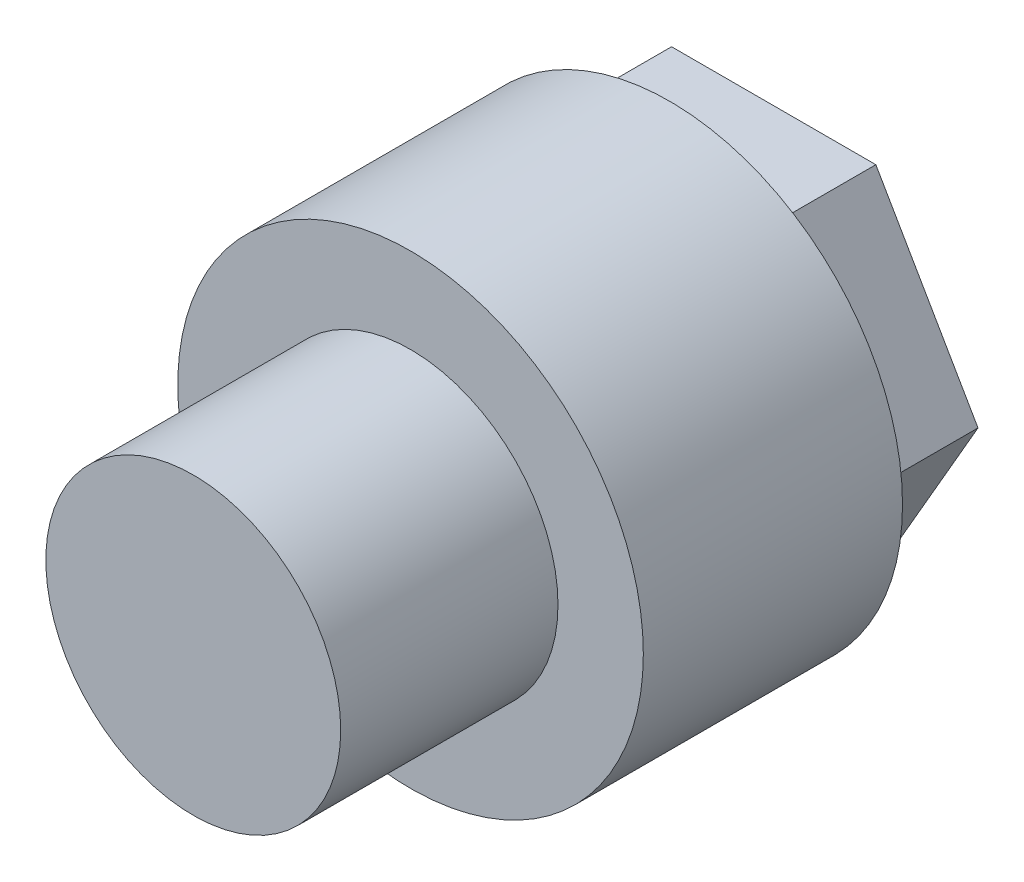
ISO-10303-21;
HEADER;
FILE_DESCRIPTION(('STEP AP214'),'2;1');
FILE_NAME('part.step','',(''),(''),'','','');
FILE_SCHEMA(('AUTOMOTIVE_DESIGN { 1 0 10303 214 1 1 1 1 }'));
ENDSEC;
DATA;
#1=APPLICATION_CONTEXT('core data for automotive mechanical design processes');
#2=APPLICATION_PROTOCOL_DEFINITION('international standard','automotive_design',2000,#1);
#3=PRODUCT_CONTEXT('',#1,'mechanical');
#4=PRODUCT('Part','Part','',(#3));
#5=PRODUCT_RELATED_PRODUCT_CATEGORY('part','',(#4));
#6=PRODUCT_DEFINITION_FORMATION('','',#4);
#7=PRODUCT_DEFINITION_CONTEXT('part definition',#1,'design');
#8=PRODUCT_DEFINITION('design','',#6,#7);
#9=PRODUCT_DEFINITION_SHAPE('','',#8);
#10=(LENGTH_UNIT() NAMED_UNIT(*) SI_UNIT(.MILLI.,.METRE.));
#11=(NAMED_UNIT(*) PLANE_ANGLE_UNIT() SI_UNIT($,.RADIAN.));
#12=(NAMED_UNIT(*) SI_UNIT($,.STERADIAN.) SOLID_ANGLE_UNIT());
#13=UNCERTAINTY_MEASURE_WITH_UNIT(LENGTH_MEASURE(1.E-05),#10,'distance_accuracy_value','');
#14=(GEOMETRIC_REPRESENTATION_CONTEXT(3) GLOBAL_UNCERTAINTY_ASSIGNED_CONTEXT((#13)) GLOBAL_UNIT_ASSIGNED_CONTEXT((#10,
#11,#12)) REPRESENTATION_CONTEXT('',''));
#15=CARTESIAN_POINT('',(0.,0.,0.));
#16=DIRECTION('',(0.,0.,1.));
#17=DIRECTION('',(1.,0.,0.));
#18=AXIS2_PLACEMENT_3D('',#15,#16,#17);
#19=CARTESIAN_POINT('',(0.,0.,8.35));
#20=DIRECTION('',(0.,0.,-1.));
#21=DIRECTION('',(-1.,0.,0.));
#22=AXIS2_PLACEMENT_3D('',#19,#20,#21);
#23=CYLINDRICAL_SURFACE('',#22,7.5);
#24=CARTESIAN_POINT('',(0.,0.,8.35));
#25=DIRECTION('',(0.,0.,1.));
#26=DIRECTION('',(1.,0.,0.));
#27=AXIS2_PLACEMENT_3D('',#24,#25,#26);
#28=CIRCLE('',#27,7.5);
#29=CARTESIAN_POINT('',(7.5,0.,8.35));
#30=VERTEX_POINT('',#29);
#31=EDGE_CURVE('E49',#30,#30,#28,.T.);
#32=ORIENTED_EDGE('',*,*,#31,.F.);
#33=EDGE_LOOP('',(#32));
#34=FACE_BOUND('',#33,.T.);
#35=CARTESIAN_POINT('',(0.,0.,0.));
#36=DIRECTION('',(0.,0.,1.));
#37=DIRECTION('',(1.,0.,0.));
#38=AXIS2_PLACEMENT_3D('',#35,#36,#37);
#39=CIRCLE('',#38,7.5);
#40=CARTESIAN_POINT('',(7.5,0.,0.));
#41=VERTEX_POINT('',#40);
#42=EDGE_CURVE('E44',#41,#41,#39,.T.);
#43=ORIENTED_EDGE('',*,*,#42,.T.);
#44=EDGE_LOOP('',(#43));
#45=FACE_BOUND('',#44,.T.);
#46=ADVANCED_FACE('F41',(#34,#45),#23,.T.);
#47=CARTESIAN_POINT('',(0.,0.,8.35));
#48=DIRECTION('',(0.,0.,1.));
#49=DIRECTION('',(1.,0.,0.));
#50=AXIS2_PLACEMENT_3D('',#47,#48,#49);
#51=PLANE('',#50);
#52=CARTESIAN_POINT('',(0.,0.,8.35));
#53=DIRECTION('',(0.,0.,1.));
#54=DIRECTION('',(1.,0.,0.));
#55=AXIS2_PLACEMENT_3D('',#52,#53,#54);
#56=CIRCLE('',#55,4.75);
#57=CARTESIAN_POINT('',(4.75,0.,8.35));
#58=VERTEX_POINT('',#57);
#59=EDGE_CURVE('E11',#58,#58,#56,.T.);
#60=ORIENTED_EDGE('',*,*,#59,.F.);
#61=EDGE_LOOP('',(#60));
#62=FACE_BOUND('',#61,.T.);
#63=ORIENTED_EDGE('',*,*,#31,.T.);
#64=EDGE_LOOP('',(#63));
#65=FACE_BOUND('',#64,.T.);
#66=ADVANCED_FACE('F161',(#62,#65),#51,.T.);
#67=CARTESIAN_POINT('',(0.,0.,0.));
#68=DIRECTION('',(0.,0.,1.));
#69=DIRECTION('',(1.,0.,0.));
#70=AXIS2_PLACEMENT_3D('',#67,#68,#69);
#71=PLANE('',#70);
#72=DIRECTION('',(-1.,0.,0.));
#73=VECTOR('',#72,1.);
#74=CARTESIAN_POINT('',(0.,5.69999999999999,0.));
#75=LINE('',#74,#73);
#76=CARTESIAN_POINT('',(3.29089653438088,5.69999999999999,0.));
#77=VERTEX_POINT('',#76);
#78=CARTESIAN_POINT('',(-3.29089653438085,5.69999999999999,0.));
#79=VERTEX_POINT('',#78);
#80=EDGE_CURVE('E142',#77,#79,#75,.T.);
#81=ORIENTED_EDGE('',*,*,#80,.T.);
#82=DIRECTION('',(-0.499999999999998,-0.86602540378444,0.));
#83=VECTOR('',#82,1.);
#84=CARTESIAN_POINT('',(-4.93634480157128,2.84999999999997,0.));
#85=LINE('',#84,#83);
#86=CARTESIAN_POINT('',(-6.58179306876169,0.,0.));
#87=VERTEX_POINT('',#86);
#88=EDGE_CURVE('E57',#79,#87,#85,.T.);
#89=ORIENTED_EDGE('',*,*,#88,.T.);
#90=DIRECTION('',(0.499999999999998,-0.86602540378444,0.));
#91=VECTOR('',#90,1.);
#92=CARTESIAN_POINT('',(-4.93634480157129,-2.84999999999998,0.));
#93=LINE('',#92,#91);
#94=CARTESIAN_POINT('',(-3.29089653438084,-5.70000000000001,0.));
#95=VERTEX_POINT('',#94);
#96=EDGE_CURVE('E132',#87,#95,#93,.T.);
#97=ORIENTED_EDGE('',*,*,#96,.T.);
#98=DIRECTION('',(1.,0.,0.));
#99=VECTOR('',#98,1.);
#100=CARTESIAN_POINT('',(0.,-5.70000000000001,0.));
#101=LINE('',#100,#99);
#102=CARTESIAN_POINT('',(3.29089653438088,-5.70000000000001,0.));
#103=VERTEX_POINT('',#102);
#104=EDGE_CURVE('E136',#95,#103,#101,.T.);
#105=ORIENTED_EDGE('',*,*,#104,.T.);
#106=DIRECTION('',(0.499999999999998,0.86602540378444,0.));
#107=VECTOR('',#106,1.);
#108=CARTESIAN_POINT('',(4.93634480157132,-2.84999999999999,0.));
#109=LINE('',#108,#107);
#110=CARTESIAN_POINT('',(6.58179306876173,0.,0.));
#111=VERTEX_POINT('',#110);
#112=EDGE_CURVE('E139',#103,#111,#109,.T.);
#113=ORIENTED_EDGE('',*,*,#112,.T.);
#114=DIRECTION('',(-0.499999999999998,0.86602540378444,0.));
#115=VECTOR('',#114,1.);
#116=CARTESIAN_POINT('',(4.93634480157131,2.84999999999999,0.));
#117=LINE('',#116,#115);
#118=EDGE_CURVE('E107',#111,#77,#117,.T.);
#119=ORIENTED_EDGE('',*,*,#118,.T.);
#120=EDGE_LOOP('',(#81,#89,#97,#105,#113,#119));
#121=FACE_BOUND('',#120,.T.);
#122=ORIENTED_EDGE('',*,*,#42,.F.);
#123=EDGE_LOOP('',(#122));
#124=FACE_BOUND('',#123,.T.);
#125=ADVANCED_FACE('F158',(#121,#124),#71,.F.);
#126=CARTESIAN_POINT('',(-4.93634480157128,2.84999999999997,-3.35));
#127=DIRECTION('',(-0.86602540378444,0.499999999999998,0.));
#128=DIRECTION('',(-0.499999999999998,-0.86602540378444,0.));
#129=AXIS2_PLACEMENT_3D('',#126,#127,#128);
#130=PLANE('',#129);
#131=ORIENTED_EDGE('',*,*,#88,.F.);
#132=DIRECTION('',(0.,0.,1.));
#133=VECTOR('',#132,1.);
#134=CARTESIAN_POINT('',(-3.29089653438085,5.69999999999999,-3.35));
#135=LINE('',#134,#133);
#136=CARTESIAN_POINT('',(-3.29089653438085,5.69999999999999,-3.35));
#137=VERTEX_POINT('',#136);
#138=EDGE_CURVE('E62',#137,#79,#135,.T.);
#139=ORIENTED_EDGE('',*,*,#138,.F.);
#140=DIRECTION('',(-0.499999999999998,-0.86602540378444,0.));
#141=VECTOR('',#140,1.);
#142=CARTESIAN_POINT('',(-4.93634480157128,2.84999999999997,-3.35));
#143=LINE('',#142,#141);
#144=CARTESIAN_POINT('',(-6.58179306876169,0.,-3.35));
#145=VERTEX_POINT('',#144);
#146=EDGE_CURVE('E145',#137,#145,#143,.T.);
#147=ORIENTED_EDGE('',*,*,#146,.T.);
#148=DIRECTION('',(0.,0.,1.));
#149=VECTOR('',#148,1.);
#150=CARTESIAN_POINT('',(-6.58179306876169,0.,-3.35));
#151=LINE('',#150,#149);
#152=EDGE_CURVE('E93',#145,#87,#151,.T.);
#153=ORIENTED_EDGE('',*,*,#152,.T.);
#154=EDGE_LOOP('',(#131,#139,#147,#153));
#155=FACE_BOUND('',#154,.T.);
#156=ADVANCED_FACE('F160',(#155),#130,.T.);
#157=CARTESIAN_POINT('',(0.,5.69999999999999,-3.35));
#158=DIRECTION('',(0.,1.,0.));
#159=DIRECTION('',(-1.,0.,0.));
#160=AXIS2_PLACEMENT_3D('',#157,#158,#159);
#161=PLANE('',#160);
#162=ORIENTED_EDGE('',*,*,#80,.F.);
#163=DIRECTION('',(0.,0.,1.));
#164=VECTOR('',#163,1.);
#165=CARTESIAN_POINT('',(3.29089653438088,5.69999999999999,-3.35));
#166=LINE('',#165,#164);
#167=CARTESIAN_POINT('',(3.29089653438088,5.69999999999999,-3.35));
#168=VERTEX_POINT('',#167);
#169=EDGE_CURVE('E85',#168,#77,#166,.T.);
#170=ORIENTED_EDGE('',*,*,#169,.F.);
#171=DIRECTION('',(-1.,0.,0.));
#172=VECTOR('',#171,1.);
#173=CARTESIAN_POINT('',(0.,5.69999999999999,-3.35));
#174=LINE('',#173,#172);
#175=EDGE_CURVE('E121',#168,#137,#174,.T.);
#176=ORIENTED_EDGE('',*,*,#175,.T.);
#177=ORIENTED_EDGE('',*,*,#138,.T.);
#178=EDGE_LOOP('',(#162,#170,#176,#177));
#179=FACE_BOUND('',#178,.T.);
#180=ADVANCED_FACE('F167',(#179),#161,.T.);
#181=CARTESIAN_POINT('',(4.93634480157131,2.84999999999999,-3.35));
#182=DIRECTION('',(0.86602540378444,0.499999999999998,0.));
#183=DIRECTION('',(-0.499999999999998,0.86602540378444,0.));
#184=AXIS2_PLACEMENT_3D('',#181,#182,#183);
#185=PLANE('',#184);
#186=ORIENTED_EDGE('',*,*,#118,.F.);
#187=DIRECTION('',(0.,0.,1.));
#188=VECTOR('',#187,1.);
#189=CARTESIAN_POINT('',(6.58179306876173,0.,-3.35));
#190=LINE('',#189,#188);
#191=CARTESIAN_POINT('',(6.58179306876173,0.,-3.35));
#192=VERTEX_POINT('',#191);
#193=EDGE_CURVE('E101',#192,#111,#190,.T.);
#194=ORIENTED_EDGE('',*,*,#193,.F.);
#195=DIRECTION('',(-0.499999999999998,0.86602540378444,0.));
#196=VECTOR('',#195,1.);
#197=CARTESIAN_POINT('',(4.93634480157131,2.84999999999999,-3.35));
#198=LINE('',#197,#196);
#199=EDGE_CURVE('E104',#192,#168,#198,.T.);
#200=ORIENTED_EDGE('',*,*,#199,.T.);
#201=ORIENTED_EDGE('',*,*,#169,.T.);
#202=EDGE_LOOP('',(#186,#194,#200,#201));
#203=FACE_BOUND('',#202,.T.);
#204=ADVANCED_FACE('F103',(#203),#185,.T.);
#205=CARTESIAN_POINT('',(4.93634480157132,-2.84999999999999,-3.35));
#206=DIRECTION('',(0.86602540378444,-0.499999999999998,0.));
#207=DIRECTION('',(0.499999999999998,0.86602540378444,0.));
#208=AXIS2_PLACEMENT_3D('',#205,#206,#207);
#209=PLANE('',#208);
#210=ORIENTED_EDGE('',*,*,#112,.F.);
#211=DIRECTION('',(0.,0.,1.));
#212=VECTOR('',#211,1.);
#213=CARTESIAN_POINT('',(3.29089653438088,-5.70000000000001,-3.35));
#214=LINE('',#213,#212);
#215=CARTESIAN_POINT('',(3.29089653438088,-5.70000000000001,-3.35));
#216=VERTEX_POINT('',#215);
#217=EDGE_CURVE('E112',#216,#103,#214,.T.);
#218=ORIENTED_EDGE('',*,*,#217,.F.);
#219=DIRECTION('',(0.499999999999998,0.86602540378444,0.));
#220=VECTOR('',#219,1.);
#221=CARTESIAN_POINT('',(4.93634480157132,-2.84999999999999,-3.35));
#222=LINE('',#221,#220);
#223=EDGE_CURVE('E118',#216,#192,#222,.T.);
#224=ORIENTED_EDGE('',*,*,#223,.T.);
#225=ORIENTED_EDGE('',*,*,#193,.T.);
#226=EDGE_LOOP('',(#210,#218,#224,#225));
#227=FACE_BOUND('',#226,.T.);
#228=ADVANCED_FACE('F123',(#227),#209,.T.);
#229=CARTESIAN_POINT('',(0.,-5.70000000000001,-3.35));
#230=DIRECTION('',(0.,-1.,0.));
#231=DIRECTION('',(0.,0.,-1.));
#232=AXIS2_PLACEMENT_3D('',#229,#230,#231);
#233=PLANE('',#232);
#234=ORIENTED_EDGE('',*,*,#104,.F.);
#235=DIRECTION('',(0.,0.,1.));
#236=VECTOR('',#235,1.);
#237=CARTESIAN_POINT('',(-3.29089653438084,-5.70000000000001,-3.35));
#238=LINE('',#237,#236);
#239=CARTESIAN_POINT('',(-3.29089653438084,-5.70000000000001,-3.35));
#240=VERTEX_POINT('',#239);
#241=EDGE_CURVE('E149',#240,#95,#238,.T.);
#242=ORIENTED_EDGE('',*,*,#241,.F.);
#243=DIRECTION('',(1.,0.,0.));
#244=VECTOR('',#243,1.);
#245=CARTESIAN_POINT('',(0.,-5.70000000000001,-3.35));
#246=LINE('',#245,#244);
#247=EDGE_CURVE('E124',#240,#216,#246,.T.);
#248=ORIENTED_EDGE('',*,*,#247,.T.);
#249=ORIENTED_EDGE('',*,*,#217,.T.);
#250=EDGE_LOOP('',(#234,#242,#248,#249));
#251=FACE_BOUND('',#250,.T.);
#252=ADVANCED_FACE('F220',(#251),#233,.T.);
#253=CARTESIAN_POINT('',(-4.93634480157129,-2.84999999999998,-3.35));
#254=DIRECTION('',(-0.86602540378444,-0.499999999999998,0.));
#255=DIRECTION('',(0.499999999999998,-0.86602540378444,0.));
#256=AXIS2_PLACEMENT_3D('',#253,#254,#255);
#257=PLANE('',#256);
#258=ORIENTED_EDGE('',*,*,#96,.F.);
#259=ORIENTED_EDGE('',*,*,#152,.F.);
#260=DIRECTION('',(0.499999999999998,-0.86602540378444,0.));
#261=VECTOR('',#260,1.);
#262=CARTESIAN_POINT('',(-4.93634480157129,-2.84999999999998,-3.35));
#263=LINE('',#262,#261);
#264=EDGE_CURVE('E126',#145,#240,#263,.T.);
#265=ORIENTED_EDGE('',*,*,#264,.T.);
#266=ORIENTED_EDGE('',*,*,#241,.T.);
#267=EDGE_LOOP('',(#258,#259,#265,#266));
#268=FACE_BOUND('',#267,.T.);
#269=ADVANCED_FACE('F229',(#268),#257,.T.);
#270=CARTESIAN_POINT('',(0.,0.,-3.35));
#271=DIRECTION('',(0.,0.,1.));
#272=DIRECTION('',(1.,0.,0.));
#273=AXIS2_PLACEMENT_3D('',#270,#271,#272);
#274=PLANE('',#273);
#275=ORIENTED_EDGE('',*,*,#146,.F.);
#276=ORIENTED_EDGE('',*,*,#175,.F.);
#277=ORIENTED_EDGE('',*,*,#199,.F.);
#278=ORIENTED_EDGE('',*,*,#223,.F.);
#279=ORIENTED_EDGE('',*,*,#247,.F.);
#280=ORIENTED_EDGE('',*,*,#264,.F.);
#281=EDGE_LOOP('',(#275,#276,#277,#278,#279,#280));
#282=FACE_BOUND('',#281,.T.);
#283=ADVANCED_FACE('F116',(#282),#274,.F.);
#284=CARTESIAN_POINT('',(0.,0.,15.35));
#285=DIRECTION('',(0.,0.,-1.));
#286=DIRECTION('',(-1.,0.,0.));
#287=AXIS2_PLACEMENT_3D('',#284,#285,#286);
#288=CYLINDRICAL_SURFACE('',#287,4.75);
#289=CARTESIAN_POINT('',(0.,0.,15.35));
#290=DIRECTION('',(0.,0.,1.));
#291=DIRECTION('',(1.,0.,0.));
#292=AXIS2_PLACEMENT_3D('',#289,#290,#291);
#293=CIRCLE('',#292,4.75);
#294=CARTESIAN_POINT('',(4.75,0.,15.35));
#295=VERTEX_POINT('',#294);
#296=EDGE_CURVE('E133',#295,#295,#293,.T.);
#297=ORIENTED_EDGE('',*,*,#296,.F.);
#298=EDGE_LOOP('',(#297));
#299=FACE_BOUND('',#298,.T.);
#300=ORIENTED_EDGE('',*,*,#59,.T.);
#301=EDGE_LOOP('',(#300));
#302=FACE_BOUND('',#301,.T.);
#303=ADVANCED_FACE('F246',(#299,#302),#288,.T.);
#304=CARTESIAN_POINT('',(0.,0.,15.35));
#305=DIRECTION('',(0.,0.,1.));
#306=DIRECTION('',(1.,0.,0.));
#307=AXIS2_PLACEMENT_3D('',#304,#305,#306);
#308=PLANE('',#307);
#309=ORIENTED_EDGE('',*,*,#296,.T.);
#310=EDGE_LOOP('',(#309));
#311=FACE_BOUND('',#310,.T.);
#312=ADVANCED_FACE('F254',(#311),#308,.T.);
#313=CLOSED_SHELL('',(#46,#66,#125,#156,#180,#204,#228,#252,#269,#283,#303,#312));
#314=MANIFOLD_SOLID_BREP('B2',#313);
#315=ADVANCED_BREP_SHAPE_REPRESENTATION('',(#18,#314),#14);
#316=SHAPE_DEFINITION_REPRESENTATION(#9,#315);
ENDSEC;
END-ISO-10303-21;
